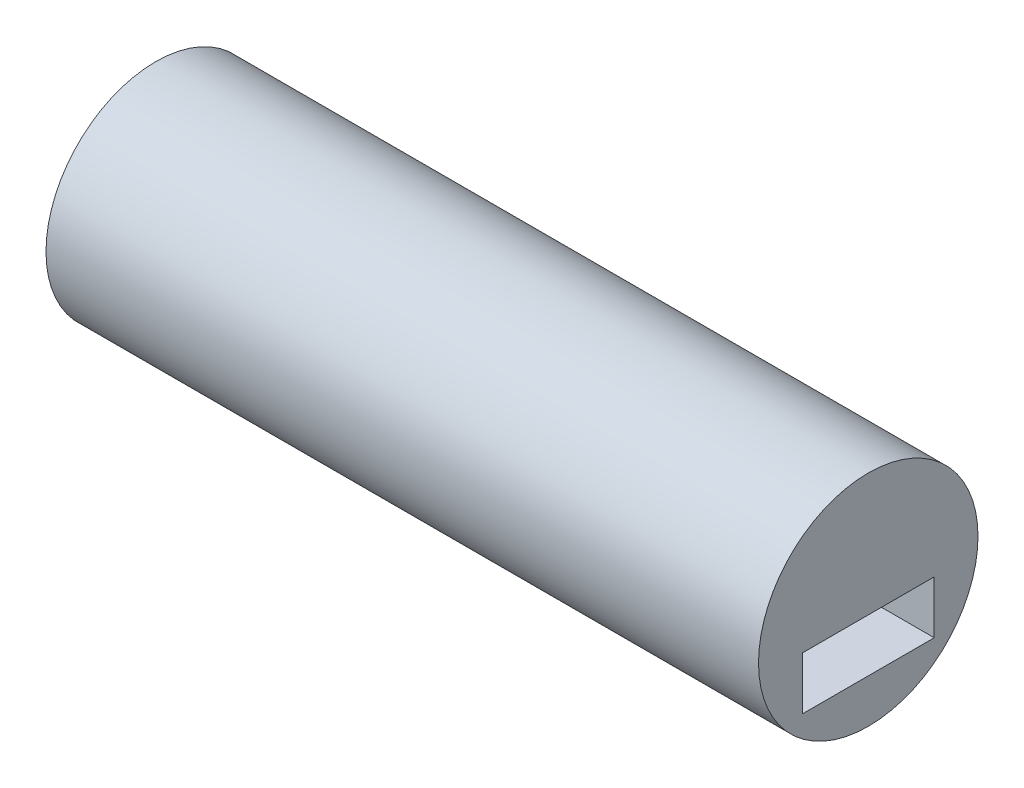
ISO-10303-21;
HEADER;
FILE_DESCRIPTION(('STEP AP214'),'2;1');
FILE_NAME('part.step','',(''),(''),'','','');
FILE_SCHEMA(('AUTOMOTIVE_DESIGN { 1 0 10303 214 1 1 1 1 }'));
ENDSEC;
DATA;
#1=APPLICATION_CONTEXT('core data for automotive mechanical design processes');
#2=APPLICATION_PROTOCOL_DEFINITION('international standard','automotive_design',2000,#1);
#3=PRODUCT_CONTEXT('',#1,'mechanical');
#4=PRODUCT('Part','Part','',(#3));
#5=PRODUCT_RELATED_PRODUCT_CATEGORY('part','',(#4));
#6=PRODUCT_DEFINITION_FORMATION('','',#4);
#7=PRODUCT_DEFINITION_CONTEXT('part definition',#1,'design');
#8=PRODUCT_DEFINITION('design','',#6,#7);
#9=PRODUCT_DEFINITION_SHAPE('','',#8);
#10=(LENGTH_UNIT() NAMED_UNIT(*) SI_UNIT(.MILLI.,.METRE.));
#11=(NAMED_UNIT(*) PLANE_ANGLE_UNIT() SI_UNIT($,.RADIAN.));
#12=(NAMED_UNIT(*) SI_UNIT($,.STERADIAN.) SOLID_ANGLE_UNIT());
#13=UNCERTAINTY_MEASURE_WITH_UNIT(LENGTH_MEASURE(1.E-05),#10,'distance_accuracy_value','');
#14=(GEOMETRIC_REPRESENTATION_CONTEXT(3) GLOBAL_UNCERTAINTY_ASSIGNED_CONTEXT((#13)) GLOBAL_UNIT_ASSIGNED_CONTEXT((#10,
#11,#12)) REPRESENTATION_CONTEXT('',''));
#15=CARTESIAN_POINT('',(0.,0.,0.));
#16=DIRECTION('',(0.,0.,1.));
#17=DIRECTION('',(1.,0.,0.));
#18=AXIS2_PLACEMENT_3D('',#15,#16,#17);
#19=CARTESIAN_POINT('',(540.,0.,0.));
#20=DIRECTION('',(1.,0.,0.));
#21=DIRECTION('',(0.,0.,-1.));
#22=AXIS2_PLACEMENT_3D('',#19,#20,#21);
#23=PLANE('',#22);
#24=DIRECTION('',(0.,0.,-1.));
#25=VECTOR('',#24,1.);
#26=CARTESIAN_POINT('',(540.,-50.,50.));
#27=LINE('',#26,#25);
#28=CARTESIAN_POINT('',(540.,-50.,50.));
#29=VERTEX_POINT('',#28);
#30=CARTESIAN_POINT('',(540.,-50.,-50.));
#31=VERTEX_POINT('',#30);
#32=EDGE_CURVE('E83',#29,#31,#27,.T.);
#33=ORIENTED_EDGE('',*,*,#32,.F.);
#34=DIRECTION('',(0.,-1.,0.));
#35=VECTOR('',#34,1.);
#36=CARTESIAN_POINT('',(540.,-50.,50.));
#37=LINE('',#36,#35);
#38=CARTESIAN_POINT('',(540.,-10.,50.));
#39=VERTEX_POINT('',#38);
#40=EDGE_CURVE('E76',#39,#29,#37,.T.);
#41=ORIENTED_EDGE('',*,*,#40,.F.);
#42=DIRECTION('',(0.,0.,1.));
#43=VECTOR('',#42,1.);
#44=CARTESIAN_POINT('',(540.,-10.,50.));
#45=LINE('',#44,#43);
#46=CARTESIAN_POINT('',(540.,-10.,-50.));
#47=VERTEX_POINT('',#46);
#48=EDGE_CURVE('E95',#47,#39,#45,.T.);
#49=ORIENTED_EDGE('',*,*,#48,.F.);
#50=DIRECTION('',(0.,1.,0.));
#51=VECTOR('',#50,1.);
#52=CARTESIAN_POINT('',(540.,-50.,-50.));
#53=LINE('',#52,#51);
#54=EDGE_CURVE('E93',#31,#47,#53,.T.);
#55=ORIENTED_EDGE('',*,*,#54,.F.);
#56=EDGE_LOOP('',(#33,#41,#49,#55));
#57=FACE_BOUND('',#56,.T.);
#58=CARTESIAN_POINT('',(540.,0.,0.));
#59=DIRECTION('',(1.,0.,0.));
#60=DIRECTION('',(0.,0.,-1.));
#61=AXIS2_PLACEMENT_3D('',#58,#59,#60);
#62=CIRCLE('',#61,83.17284);
#63=CARTESIAN_POINT('',(540.,0.,-83.17284));
#64=VERTEX_POINT('',#63);
#65=EDGE_CURVE('E176',#64,#64,#62,.T.);
#66=ORIENTED_EDGE('',*,*,#65,.T.);
#67=EDGE_LOOP('',(#66));
#68=FACE_BOUND('',#67,.T.);
#69=ADVANCED_FACE('F36',(#57,#68),#23,.T.);
#70=CARTESIAN_POINT('',(0.,0.,0.));
#71=DIRECTION('',(1.,0.,0.));
#72=DIRECTION('',(0.,0.,-1.));
#73=AXIS2_PLACEMENT_3D('',#70,#71,#72);
#74=PLANE('',#73);
#75=DIRECTION('',(0.,-1.,0.));
#76=VECTOR('',#75,1.);
#77=CARTESIAN_POINT('',(0.,-50.,50.));
#78=LINE('',#77,#76);
#79=CARTESIAN_POINT('',(0.,-10.,50.));
#80=VERTEX_POINT('',#79);
#81=CARTESIAN_POINT('',(0.,-50.,50.));
#82=VERTEX_POINT('',#81);
#83=EDGE_CURVE('E58',#80,#82,#78,.T.);
#84=ORIENTED_EDGE('',*,*,#83,.T.);
#85=DIRECTION('',(0.,0.,-1.));
#86=VECTOR('',#85,1.);
#87=CARTESIAN_POINT('',(0.,-50.,50.));
#88=LINE('',#87,#86);
#89=CARTESIAN_POINT('',(0.,-50.,-50.));
#90=VERTEX_POINT('',#89);
#91=EDGE_CURVE('E90',#82,#90,#88,.T.);
#92=ORIENTED_EDGE('',*,*,#91,.T.);
#93=DIRECTION('',(0.,1.,0.));
#94=VECTOR('',#93,1.);
#95=CARTESIAN_POINT('',(0.,-50.,-50.));
#96=LINE('',#95,#94);
#97=CARTESIAN_POINT('',(0.,-10.,-50.));
#98=VERTEX_POINT('',#97);
#99=EDGE_CURVE('E103',#90,#98,#96,.T.);
#100=ORIENTED_EDGE('',*,*,#99,.T.);
#101=DIRECTION('',(0.,0.,1.));
#102=VECTOR('',#101,1.);
#103=CARTESIAN_POINT('',(0.,-10.,50.));
#104=LINE('',#103,#102);
#105=EDGE_CURVE('E84',#98,#80,#104,.T.);
#106=ORIENTED_EDGE('',*,*,#105,.T.);
#107=EDGE_LOOP('',(#84,#92,#100,#106));
#108=FACE_BOUND('',#107,.T.);
#109=CARTESIAN_POINT('',(0.,0.,0.));
#110=DIRECTION('',(1.,0.,0.));
#111=DIRECTION('',(0.,0.,-1.));
#112=AXIS2_PLACEMENT_3D('',#109,#110,#111);
#113=CIRCLE('',#112,83.17284);
#114=CARTESIAN_POINT('',(0.,0.,-83.17284));
#115=VERTEX_POINT('',#114);
#116=EDGE_CURVE('E101',#115,#115,#113,.T.);
#117=ORIENTED_EDGE('',*,*,#116,.F.);
#118=EDGE_LOOP('',(#117));
#119=FACE_BOUND('',#118,.T.);
#120=ADVANCED_FACE('F38',(#108,#119),#74,.F.);
#121=CARTESIAN_POINT('',(540.,-50.,50.));
#122=DIRECTION('',(0.,0.,-1.));
#123=DIRECTION('',(-1.,0.,0.));
#124=AXIS2_PLACEMENT_3D('',#121,#122,#123);
#125=PLANE('',#124);
#126=ORIENTED_EDGE('',*,*,#83,.F.);
#127=DIRECTION('',(-1.,0.,0.));
#128=VECTOR('',#127,1.);
#129=CARTESIAN_POINT('',(540.,-10.,50.));
#130=LINE('',#129,#128);
#131=EDGE_CURVE('E79',#39,#80,#130,.T.);
#132=ORIENTED_EDGE('',*,*,#131,.F.);
#133=ORIENTED_EDGE('',*,*,#40,.T.);
#134=DIRECTION('',(-1.,0.,0.));
#135=VECTOR('',#134,1.);
#136=CARTESIAN_POINT('',(540.,-50.,50.));
#137=LINE('',#136,#135);
#138=EDGE_CURVE('E12',#29,#82,#137,.T.);
#139=ORIENTED_EDGE('',*,*,#138,.T.);
#140=EDGE_LOOP('',(#126,#132,#133,#139));
#141=FACE_BOUND('',#140,.T.);
#142=ADVANCED_FACE('F78',(#141),#125,.T.);
#143=CARTESIAN_POINT('',(540.,-50.,50.));
#144=DIRECTION('',(0.,1.,0.));
#145=DIRECTION('',(0.,0.,1.));
#146=AXIS2_PLACEMENT_3D('',#143,#144,#145);
#147=PLANE('',#146);
#148=ORIENTED_EDGE('',*,*,#91,.F.);
#149=ORIENTED_EDGE('',*,*,#138,.F.);
#150=ORIENTED_EDGE('',*,*,#32,.T.);
#151=DIRECTION('',(-1.,0.,0.));
#152=VECTOR('',#151,1.);
#153=CARTESIAN_POINT('',(540.,-50.,-50.));
#154=LINE('',#153,#152);
#155=EDGE_CURVE('E44',#31,#90,#154,.T.);
#156=ORIENTED_EDGE('',*,*,#155,.T.);
#157=EDGE_LOOP('',(#148,#149,#150,#156));
#158=FACE_BOUND('',#157,.T.);
#159=ADVANCED_FACE('F87',(#158),#147,.T.);
#160=CARTESIAN_POINT('',(540.,-50.,-50.));
#161=DIRECTION('',(0.,0.,1.));
#162=DIRECTION('',(1.,0.,0.));
#163=AXIS2_PLACEMENT_3D('',#160,#161,#162);
#164=PLANE('',#163);
#165=ORIENTED_EDGE('',*,*,#99,.F.);
#166=ORIENTED_EDGE('',*,*,#155,.F.);
#167=ORIENTED_EDGE('',*,*,#54,.T.);
#168=DIRECTION('',(-1.,0.,0.));
#169=VECTOR('',#168,1.);
#170=CARTESIAN_POINT('',(540.,-10.,-50.));
#171=LINE('',#170,#169);
#172=EDGE_CURVE('E51',#47,#98,#171,.T.);
#173=ORIENTED_EDGE('',*,*,#172,.T.);
#174=EDGE_LOOP('',(#165,#166,#167,#173));
#175=FACE_BOUND('',#174,.T.);
#176=ADVANCED_FACE('F111',(#175),#164,.T.);
#177=CARTESIAN_POINT('',(540.,-10.,50.));
#178=DIRECTION('',(0.,-1.,0.));
#179=DIRECTION('',(0.,0.,-1.));
#180=AXIS2_PLACEMENT_3D('',#177,#178,#179);
#181=PLANE('',#180);
#182=ORIENTED_EDGE('',*,*,#105,.F.);
#183=ORIENTED_EDGE('',*,*,#172,.F.);
#184=ORIENTED_EDGE('',*,*,#48,.T.);
#185=ORIENTED_EDGE('',*,*,#131,.T.);
#186=EDGE_LOOP('',(#182,#183,#184,#185));
#187=FACE_BOUND('',#186,.T.);
#188=ADVANCED_FACE('F114',(#187),#181,.T.);
#189=CARTESIAN_POINT('',(0.,0.,0.));
#190=DIRECTION('',(1.,0.,0.));
#191=DIRECTION('',(0.,0.,-1.));
#192=AXIS2_PLACEMENT_3D('',#189,#190,#191);
#193=CYLINDRICAL_SURFACE('',#192,83.17284);
#194=ORIENTED_EDGE('',*,*,#116,.T.);
#195=EDGE_LOOP('',(#194));
#196=FACE_BOUND('',#195,.T.);
#197=ORIENTED_EDGE('',*,*,#65,.F.);
#198=EDGE_LOOP('',(#197));
#199=FACE_BOUND('',#198,.T.);
#200=ADVANCED_FACE('F116',(#196,#199),#193,.T.);
#201=CLOSED_SHELL('',(#69,#120,#142,#159,#176,#188,#200));
#202=MANIFOLD_SOLID_BREP('B2',#201);
#203=ADVANCED_BREP_SHAPE_REPRESENTATION('',(#18,#202),#14);
#204=SHAPE_DEFINITION_REPRESENTATION(#9,#203);
ENDSEC;
END-ISO-10303-21;
